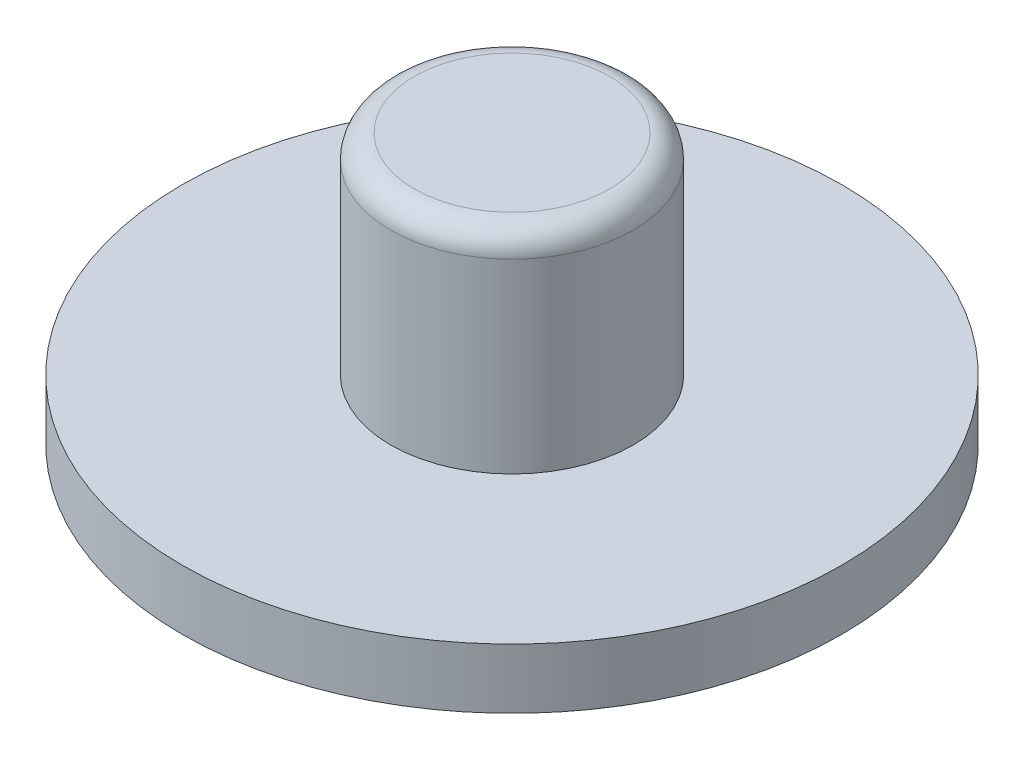
ISO-10303-21;
HEADER;
FILE_DESCRIPTION(('STEP AP214'),'2;1');
FILE_NAME('part.step','',(''),(''),'','','');
FILE_SCHEMA(('AUTOMOTIVE_DESIGN { 1 0 10303 214 1 1 1 1 }'));
ENDSEC;
DATA;
#1=APPLICATION_CONTEXT('core data for automotive mechanical design processes');
#2=APPLICATION_PROTOCOL_DEFINITION('international standard','automotive_design',2000,#1);
#3=PRODUCT_CONTEXT('',#1,'mechanical');
#4=PRODUCT('Part','Part','',(#3));
#5=PRODUCT_RELATED_PRODUCT_CATEGORY('part','',(#4));
#6=PRODUCT_DEFINITION_FORMATION('','',#4);
#7=PRODUCT_DEFINITION_CONTEXT('part definition',#1,'design');
#8=PRODUCT_DEFINITION('design','',#6,#7);
#9=PRODUCT_DEFINITION_SHAPE('','',#8);
#10=(LENGTH_UNIT() NAMED_UNIT(*) SI_UNIT(.MILLI.,.METRE.));
#11=(NAMED_UNIT(*) PLANE_ANGLE_UNIT() SI_UNIT($,.RADIAN.));
#12=(NAMED_UNIT(*) SI_UNIT($,.STERADIAN.) SOLID_ANGLE_UNIT());
#13=UNCERTAINTY_MEASURE_WITH_UNIT(LENGTH_MEASURE(1.E-05),#10,'distance_accuracy_value','');
#14=(GEOMETRIC_REPRESENTATION_CONTEXT(3) GLOBAL_UNCERTAINTY_ASSIGNED_CONTEXT((#13)) GLOBAL_UNIT_ASSIGNED_CONTEXT((#10,
#11,#12)) REPRESENTATION_CONTEXT('',''));
#15=CARTESIAN_POINT('',(0.,0.,0.));
#16=DIRECTION('',(0.,0.,1.));
#17=DIRECTION('',(1.,0.,0.));
#18=AXIS2_PLACEMENT_3D('',#15,#16,#17);
#19=CARTESIAN_POINT('',(0.,3.5,0.));
#20=DIRECTION('',(0.,-1.,0.));
#21=DIRECTION('',(0.,0.,-1.));
#22=AXIS2_PLACEMENT_3D('',#19,#20,#21);
#23=CYLINDRICAL_SURFACE('',#22,4.05);
#24=CARTESIAN_POINT('',(0.,2.70625,0.));
#25=DIRECTION('',(0.,1.,0.));
#26=DIRECTION('',(0.,0.,1.));
#27=AXIS2_PLACEMENT_3D('',#24,#25,#26);
#28=CIRCLE('',#27,4.05);
#29=CARTESIAN_POINT('',(0.,2.70625,4.05));
#30=VERTEX_POINT('',#29);
#31=EDGE_CURVE('E10',#30,#30,#28,.F.);
#32=ORIENTED_EDGE('',*,*,#31,.T.);
#33=EDGE_LOOP('',(#32));
#34=FACE_BOUND('',#33,.T.);
#35=CARTESIAN_POINT('',(0.,-3.5,0.));
#36=DIRECTION('',(0.,1.,0.));
#37=DIRECTION('',(0.,0.,1.));
#38=AXIS2_PLACEMENT_3D('',#35,#36,#37);
#39=CIRCLE('',#38,4.05);
#40=CARTESIAN_POINT('',(0.,-3.5,4.05));
#41=VERTEX_POINT('',#40);
#42=EDGE_CURVE('E42',#41,#41,#39,.T.);
#43=ORIENTED_EDGE('',*,*,#42,.T.);
#44=EDGE_LOOP('',(#43));
#45=FACE_BOUND('',#44,.T.);
#46=ADVANCED_FACE('F31',(#34,#45),#23,.T.);
#47=CARTESIAN_POINT('',(0.,3.5,0.));
#48=DIRECTION('',(0.,1.,0.));
#49=DIRECTION('',(0.,0.,1.));
#50=AXIS2_PLACEMENT_3D('',#47,#48,#49);
#51=PLANE('',#50);
#52=CARTESIAN_POINT('',(0.,3.5,0.));
#53=DIRECTION('',(0.,1.,0.));
#54=DIRECTION('',(0.,0.,1.));
#55=AXIS2_PLACEMENT_3D('',#52,#53,#54);
#56=CIRCLE('',#55,3.25625);
#57=CARTESIAN_POINT('',(0.,3.5,3.25625));
#58=VERTEX_POINT('',#57);
#59=EDGE_CURVE('E38',#58,#58,#56,.T.);
#60=ORIENTED_EDGE('',*,*,#59,.T.);
#61=EDGE_LOOP('',(#60));
#62=FACE_BOUND('',#61,.T.);
#63=ADVANCED_FACE('F73',(#62),#51,.T.);
#64=CARTESIAN_POINT('',(0.,2.70625,0.));
#65=DIRECTION('',(0.,1.,0.));
#66=DIRECTION('',(0.,0.,1.));
#67=AXIS2_PLACEMENT_3D('',#64,#65,#66);
#68=TOROIDAL_SURFACE('',#67,3.25625,0.79375);
#69=ORIENTED_EDGE('',*,*,#31,.F.);
#70=EDGE_LOOP('',(#69));
#71=FACE_BOUND('',#70,.T.);
#72=ORIENTED_EDGE('',*,*,#59,.F.);
#73=EDGE_LOOP('',(#72));
#74=FACE_BOUND('',#73,.T.);
#75=ADVANCED_FACE('F33',(#71,#74),#68,.T.);
#76=CARTESIAN_POINT('',(0.,-5.5,0.));
#77=DIRECTION('',(0.,1.,0.));
#78=DIRECTION('',(0.,0.,1.));
#79=AXIS2_PLACEMENT_3D('',#76,#77,#78);
#80=CYLINDRICAL_SURFACE('',#79,11.);
#81=CARTESIAN_POINT('',(0.,-5.5,0.));
#82=DIRECTION('',(0.,-1.,0.));
#83=DIRECTION('',(0.,0.,-1.));
#84=AXIS2_PLACEMENT_3D('',#81,#82,#83);
#85=CIRCLE('',#84,11.);
#86=CARTESIAN_POINT('',(0.,-5.5,-11.));
#87=VERTEX_POINT('',#86);
#88=EDGE_CURVE('E46',#87,#87,#85,.T.);
#89=ORIENTED_EDGE('',*,*,#88,.F.);
#90=EDGE_LOOP('',(#89));
#91=FACE_BOUND('',#90,.T.);
#92=CARTESIAN_POINT('',(0.,-3.5,0.));
#93=DIRECTION('',(0.,-1.,0.));
#94=DIRECTION('',(0.,0.,-1.));
#95=AXIS2_PLACEMENT_3D('',#92,#93,#94);
#96=CIRCLE('',#95,11.);
#97=CARTESIAN_POINT('',(0.,-3.5,-11.));
#98=VERTEX_POINT('',#97);
#99=EDGE_CURVE('E49',#98,#98,#96,.T.);
#100=ORIENTED_EDGE('',*,*,#99,.T.);
#101=EDGE_LOOP('',(#100));
#102=FACE_BOUND('',#101,.T.);
#103=ADVANCED_FACE('F57',(#91,#102),#80,.T.);
#104=CARTESIAN_POINT('',(0.,-5.5,0.));
#105=DIRECTION('',(0.,-1.,0.));
#106=DIRECTION('',(0.,0.,-1.));
#107=AXIS2_PLACEMENT_3D('',#104,#105,#106);
#108=PLANE('',#107);
#109=ORIENTED_EDGE('',*,*,#88,.T.);
#110=EDGE_LOOP('',(#109));
#111=FACE_BOUND('',#110,.T.);
#112=ADVANCED_FACE('F55',(#111),#108,.T.);
#113=CARTESIAN_POINT('',(0.,-3.5,0.));
#114=DIRECTION('',(0.,-1.,0.));
#115=DIRECTION('',(0.,0.,-1.));
#116=AXIS2_PLACEMENT_3D('',#113,#114,#115);
#117=PLANE('',#116);
#118=ORIENTED_EDGE('',*,*,#42,.F.);
#119=EDGE_LOOP('',(#118));
#120=FACE_BOUND('',#119,.T.);
#121=ORIENTED_EDGE('',*,*,#99,.F.);
#122=EDGE_LOOP('',(#121));
#123=FACE_BOUND('',#122,.T.);
#124=ADVANCED_FACE('F63',(#120,#123),#117,.F.);
#125=CLOSED_SHELL('',(#46,#63,#75,#103,#112,#124));
#126=MANIFOLD_SOLID_BREP('B2',#125);
#127=ADVANCED_BREP_SHAPE_REPRESENTATION('',(#18,#126),#14);
#128=SHAPE_DEFINITION_REPRESENTATION(#9,#127);
ENDSEC;
END-ISO-10303-21;
